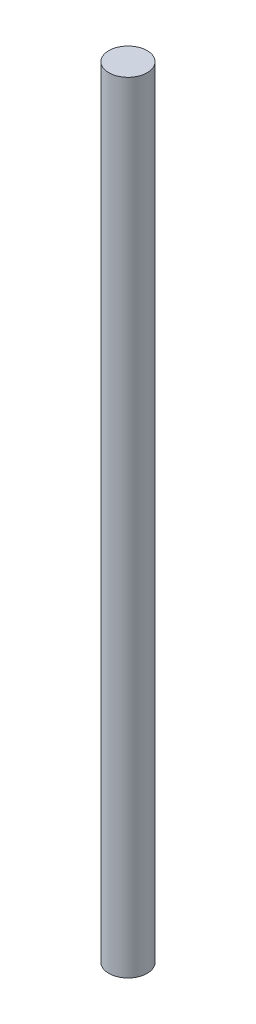
ISO-10303-21;
HEADER;
FILE_DESCRIPTION(('STEP AP214'),'2;1');
FILE_NAME('part.step','',(''),(''),'','','');
FILE_SCHEMA(('AUTOMOTIVE_DESIGN { 1 0 10303 214 1 1 1 1 }'));
ENDSEC;
DATA;
#1=APPLICATION_CONTEXT('core data for automotive mechanical design processes');
#2=APPLICATION_PROTOCOL_DEFINITION('international standard','automotive_design',2000,#1);
#3=PRODUCT_CONTEXT('',#1,'mechanical');
#4=PRODUCT('Part','Part','',(#3));
#5=PRODUCT_RELATED_PRODUCT_CATEGORY('part','',(#4));
#6=PRODUCT_DEFINITION_FORMATION('','',#4);
#7=PRODUCT_DEFINITION_CONTEXT('part definition',#1,'design');
#8=PRODUCT_DEFINITION('design','',#6,#7);
#9=PRODUCT_DEFINITION_SHAPE('','',#8);
#10=(LENGTH_UNIT() NAMED_UNIT(*) SI_UNIT(.MILLI.,.METRE.));
#11=(NAMED_UNIT(*) PLANE_ANGLE_UNIT() SI_UNIT($,.RADIAN.));
#12=(NAMED_UNIT(*) SI_UNIT($,.STERADIAN.) SOLID_ANGLE_UNIT());
#13=UNCERTAINTY_MEASURE_WITH_UNIT(LENGTH_MEASURE(1.E-05),#10,'distance_accuracy_value','');
#14=(GEOMETRIC_REPRESENTATION_CONTEXT(3) GLOBAL_UNCERTAINTY_ASSIGNED_CONTEXT((#13)) GLOBAL_UNIT_ASSIGNED_CONTEXT((#10,
#11,#12)) REPRESENTATION_CONTEXT('',''));
#15=CARTESIAN_POINT('',(0.,0.,0.));
#16=DIRECTION('',(0.,0.,1.));
#17=DIRECTION('',(1.,0.,0.));
#18=AXIS2_PLACEMENT_3D('',#15,#16,#17);
#19=CARTESIAN_POINT('',(0.,61.,0.));
#20=DIRECTION('',(0.,-1.,0.));
#21=DIRECTION('',(0.,0.,-1.));
#22=AXIS2_PLACEMENT_3D('',#19,#20,#21);
#23=CYLINDRICAL_SURFACE('',#22,1.5);
#24=CARTESIAN_POINT('',(0.,61.,0.));
#25=DIRECTION('',(0.,1.,0.));
#26=DIRECTION('',(0.,0.,1.));
#27=AXIS2_PLACEMENT_3D('',#24,#25,#26);
#28=CIRCLE('',#27,1.5);
#29=CARTESIAN_POINT('',(0.,61.,1.5));
#30=VERTEX_POINT('',#29);
#31=EDGE_CURVE('E10',#30,#30,#28,.T.);
#32=ORIENTED_EDGE('',*,*,#31,.F.);
#33=EDGE_LOOP('',(#32));
#34=FACE_BOUND('',#33,.T.);
#35=CARTESIAN_POINT('',(0.,0.,0.));
#36=DIRECTION('',(0.,1.,0.));
#37=DIRECTION('',(0.,0.,1.));
#38=AXIS2_PLACEMENT_3D('',#35,#36,#37);
#39=CIRCLE('',#38,1.5);
#40=CARTESIAN_POINT('',(0.,0.,1.5));
#41=VERTEX_POINT('',#40);
#42=EDGE_CURVE('E34',#41,#41,#39,.T.);
#43=ORIENTED_EDGE('',*,*,#42,.T.);
#44=EDGE_LOOP('',(#43));
#45=FACE_BOUND('',#44,.T.);
#46=ADVANCED_FACE('F31',(#34,#45),#23,.T.);
#47=CARTESIAN_POINT('',(0.,61.,0.));
#48=DIRECTION('',(0.,1.,0.));
#49=DIRECTION('',(0.,0.,1.));
#50=AXIS2_PLACEMENT_3D('',#47,#48,#49);
#51=PLANE('',#50);
#52=ORIENTED_EDGE('',*,*,#31,.T.);
#53=EDGE_LOOP('',(#52));
#54=FACE_BOUND('',#53,.T.);
#55=ADVANCED_FACE('F46',(#54),#51,.T.);
#56=CARTESIAN_POINT('',(0.,0.,0.));
#57=DIRECTION('',(0.,1.,0.));
#58=DIRECTION('',(0.,0.,1.));
#59=AXIS2_PLACEMENT_3D('',#56,#57,#58);
#60=PLANE('',#59);
#61=ORIENTED_EDGE('',*,*,#42,.F.);
#62=EDGE_LOOP('',(#61));
#63=FACE_BOUND('',#62,.T.);
#64=ADVANCED_FACE('F44',(#63),#60,.F.);
#65=CLOSED_SHELL('',(#46,#55,#64));
#66=MANIFOLD_SOLID_BREP('B2',#65);
#67=ADVANCED_BREP_SHAPE_REPRESENTATION('',(#18,#66),#14);
#68=SHAPE_DEFINITION_REPRESENTATION(#9,#67);
ENDSEC;
END-ISO-10303-21;
